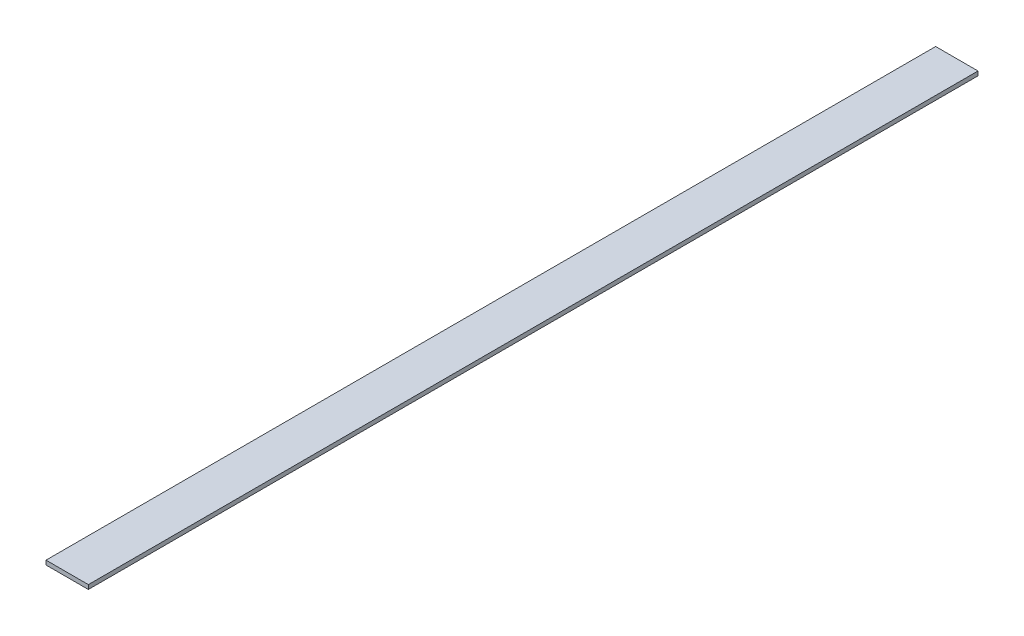
ISO-10303-21;
HEADER;
FILE_DESCRIPTION(('STEP AP214'),'2;1');
FILE_NAME('part.step','',(''),(''),'','','');
FILE_SCHEMA(('AUTOMOTIVE_DESIGN { 1 0 10303 214 1 1 1 1 }'));
ENDSEC;
DATA;
#1=APPLICATION_CONTEXT('core data for automotive mechanical design processes');
#2=APPLICATION_PROTOCOL_DEFINITION('international standard','automotive_design',2000,#1);
#3=PRODUCT_CONTEXT('',#1,'mechanical');
#4=PRODUCT('Part','Part','',(#3));
#5=PRODUCT_RELATED_PRODUCT_CATEGORY('part','',(#4));
#6=PRODUCT_DEFINITION_FORMATION('','',#4);
#7=PRODUCT_DEFINITION_CONTEXT('part definition',#1,'design');
#8=PRODUCT_DEFINITION('design','',#6,#7);
#9=PRODUCT_DEFINITION_SHAPE('','',#8);
#10=(LENGTH_UNIT() NAMED_UNIT(*) SI_UNIT(.MILLI.,.METRE.));
#11=(NAMED_UNIT(*) PLANE_ANGLE_UNIT() SI_UNIT($,.RADIAN.));
#12=(NAMED_UNIT(*) SI_UNIT($,.STERADIAN.) SOLID_ANGLE_UNIT());
#13=UNCERTAINTY_MEASURE_WITH_UNIT(LENGTH_MEASURE(1.E-05),#10,'distance_accuracy_value','');
#14=(GEOMETRIC_REPRESENTATION_CONTEXT(3) GLOBAL_UNCERTAINTY_ASSIGNED_CONTEXT((#13)) GLOBAL_UNIT_ASSIGNED_CONTEXT((#10,
#11,#12)) REPRESENTATION_CONTEXT('',''));
#15=CARTESIAN_POINT('',(0.,0.,0.));
#16=DIRECTION('',(0.,0.,1.));
#17=DIRECTION('',(1.,0.,0.));
#18=AXIS2_PLACEMENT_3D('',#15,#16,#17);
#19=CARTESIAN_POINT('',(-50.7999999999998,5.08,0.));
#20=DIRECTION('',(0.,0.,-1.));
#21=DIRECTION('',(-1.,0.,0.));
#22=AXIS2_PLACEMENT_3D('',#19,#20,#21);
#23=PLANE('',#22);
#24=DIRECTION('',(1.,0.,0.));
#25=VECTOR('',#24,1.);
#26=CARTESIAN_POINT('',(-50.7999999999998,0.,0.));
#27=LINE('',#26,#25);
#28=CARTESIAN_POINT('',(-50.7999999999998,0.,0.));
#29=VERTEX_POINT('',#28);
#30=CARTESIAN_POINT('',(0.,0.,0.));
#31=VERTEX_POINT('',#30);
#32=EDGE_CURVE('E108',#29,#31,#27,.T.);
#33=ORIENTED_EDGE('',*,*,#32,.T.);
#34=DIRECTION('',(0.,-1.,0.));
#35=VECTOR('',#34,1.);
#36=CARTESIAN_POINT('',(0.,5.08,0.));
#37=LINE('',#36,#35);
#38=CARTESIAN_POINT('',(0.,5.08,0.));
#39=VERTEX_POINT('',#38);
#40=EDGE_CURVE('E11',#39,#31,#37,.T.);
#41=ORIENTED_EDGE('',*,*,#40,.F.);
#42=DIRECTION('',(1.,0.,0.));
#43=VECTOR('',#42,1.);
#44=CARTESIAN_POINT('',(-50.7999999999998,5.08,0.));
#45=LINE('',#44,#43);
#46=CARTESIAN_POINT('',(-50.7999999999998,5.08,0.));
#47=VERTEX_POINT('',#46);
#48=EDGE_CURVE('E90',#47,#39,#45,.T.);
#49=ORIENTED_EDGE('',*,*,#48,.F.);
#50=DIRECTION('',(0.,-1.,0.));
#51=VECTOR('',#50,1.);
#52=CARTESIAN_POINT('',(-50.7999999999998,5.08,0.));
#53=LINE('',#52,#51);
#54=EDGE_CURVE('E104',#47,#29,#53,.T.);
#55=ORIENTED_EDGE('',*,*,#54,.T.);
#56=EDGE_LOOP('',(#33,#41,#49,#55));
#57=FACE_BOUND('',#56,.T.);
#58=ADVANCED_FACE('F38',(#57),#23,.F.);
#59=CARTESIAN_POINT('',(0.,5.08,0.));
#60=DIRECTION('',(-1.,0.,0.));
#61=DIRECTION('',(0.,0.,1.));
#62=AXIS2_PLACEMENT_3D('',#59,#60,#61);
#63=PLANE('',#62);
#64=DIRECTION('',(0.,0.,-1.));
#65=VECTOR('',#64,1.);
#66=CARTESIAN_POINT('',(0.,0.,0.));
#67=LINE('',#66,#65);
#68=CARTESIAN_POINT('',(0.,0.,-1066.8));
#69=VERTEX_POINT('',#68);
#70=EDGE_CURVE('E95',#31,#69,#67,.T.);
#71=ORIENTED_EDGE('',*,*,#70,.T.);
#72=DIRECTION('',(0.,-1.,0.));
#73=VECTOR('',#72,1.);
#74=CARTESIAN_POINT('',(0.,5.08,-1066.8));
#75=LINE('',#74,#73);
#76=CARTESIAN_POINT('',(0.,5.08,-1066.8));
#77=VERTEX_POINT('',#76);
#78=EDGE_CURVE('E47',#77,#69,#75,.T.);
#79=ORIENTED_EDGE('',*,*,#78,.F.);
#80=DIRECTION('',(0.,0.,-1.));
#81=VECTOR('',#80,1.);
#82=CARTESIAN_POINT('',(0.,5.08,0.));
#83=LINE('',#82,#81);
#84=EDGE_CURVE('E85',#39,#77,#83,.T.);
#85=ORIENTED_EDGE('',*,*,#84,.F.);
#86=ORIENTED_EDGE('',*,*,#40,.T.);
#87=EDGE_LOOP('',(#71,#79,#85,#86));
#88=FACE_BOUND('',#87,.T.);
#89=ADVANCED_FACE('F94',(#88),#63,.F.);
#90=CARTESIAN_POINT('',(0.,5.08,-1066.8));
#91=DIRECTION('',(0.,0.,1.));
#92=DIRECTION('',(1.,0.,0.));
#93=AXIS2_PLACEMENT_3D('',#90,#91,#92);
#94=PLANE('',#93);
#95=DIRECTION('',(-1.,0.,0.));
#96=VECTOR('',#95,1.);
#97=CARTESIAN_POINT('',(0.,0.,-1066.8));
#98=LINE('',#97,#96);
#99=CARTESIAN_POINT('',(-50.7999999999999,0.,-1066.8));
#100=VERTEX_POINT('',#99);
#101=EDGE_CURVE('E72',#69,#100,#98,.T.);
#102=ORIENTED_EDGE('',*,*,#101,.T.);
#103=DIRECTION('',(0.,-1.,0.));
#104=VECTOR('',#103,1.);
#105=CARTESIAN_POINT('',(-50.7999999999999,5.08,-1066.8));
#106=LINE('',#105,#104);
#107=CARTESIAN_POINT('',(-50.7999999999999,5.08,-1066.8));
#108=VERTEX_POINT('',#107);
#109=EDGE_CURVE('E97',#108,#100,#106,.T.);
#110=ORIENTED_EDGE('',*,*,#109,.F.);
#111=DIRECTION('',(-1.,0.,0.));
#112=VECTOR('',#111,1.);
#113=CARTESIAN_POINT('',(0.,5.08,-1066.8));
#114=LINE('',#113,#112);
#115=EDGE_CURVE('E88',#77,#108,#114,.T.);
#116=ORIENTED_EDGE('',*,*,#115,.F.);
#117=ORIENTED_EDGE('',*,*,#78,.T.);
#118=EDGE_LOOP('',(#102,#110,#116,#117));
#119=FACE_BOUND('',#118,.T.);
#120=ADVANCED_FACE('F98',(#119),#94,.F.);
#121=CARTESIAN_POINT('',(-50.7999999999999,5.08,-1066.8));
#122=DIRECTION('',(1.,0.,0.));
#123=DIRECTION('',(0.,0.,-1.));
#124=AXIS2_PLACEMENT_3D('',#121,#122,#123);
#125=PLANE('',#124);
#126=DIRECTION('',(0.,0.,1.));
#127=VECTOR('',#126,1.);
#128=CARTESIAN_POINT('',(-50.7999999999999,0.,-1066.8));
#129=LINE('',#128,#127);
#130=EDGE_CURVE('E78',#100,#29,#129,.T.);
#131=ORIENTED_EDGE('',*,*,#130,.T.);
#132=ORIENTED_EDGE('',*,*,#54,.F.);
#133=DIRECTION('',(0.,0.,1.));
#134=VECTOR('',#133,1.);
#135=CARTESIAN_POINT('',(-50.7999999999999,5.08,-1066.8));
#136=LINE('',#135,#134);
#137=EDGE_CURVE('E55',#108,#47,#136,.T.);
#138=ORIENTED_EDGE('',*,*,#137,.F.);
#139=ORIENTED_EDGE('',*,*,#109,.T.);
#140=EDGE_LOOP('',(#131,#132,#138,#139));
#141=FACE_BOUND('',#140,.T.);
#142=ADVANCED_FACE('F120',(#141),#125,.F.);
#143=CARTESIAN_POINT('',(0.,5.08,0.));
#144=DIRECTION('',(0.,1.,0.));
#145=DIRECTION('',(0.,0.,1.));
#146=AXIS2_PLACEMENT_3D('',#143,#144,#145);
#147=PLANE('',#146);
#148=ORIENTED_EDGE('',*,*,#48,.T.);
#149=ORIENTED_EDGE('',*,*,#84,.T.);
#150=ORIENTED_EDGE('',*,*,#115,.T.);
#151=ORIENTED_EDGE('',*,*,#137,.T.);
#152=EDGE_LOOP('',(#148,#149,#150,#151));
#153=FACE_BOUND('',#152,.T.);
#154=ADVANCED_FACE('F86',(#153),#147,.T.);
#155=CARTESIAN_POINT('',(0.,0.,0.));
#156=DIRECTION('',(0.,1.,0.));
#157=DIRECTION('',(0.,0.,1.));
#158=AXIS2_PLACEMENT_3D('',#155,#156,#157);
#159=PLANE('',#158);
#160=ORIENTED_EDGE('',*,*,#32,.F.);
#161=ORIENTED_EDGE('',*,*,#130,.F.);
#162=ORIENTED_EDGE('',*,*,#101,.F.);
#163=ORIENTED_EDGE('',*,*,#70,.F.);
#164=EDGE_LOOP('',(#160,#161,#162,#163));
#165=FACE_BOUND('',#164,.T.);
#166=ADVANCED_FACE('F123',(#165),#159,.F.);
#167=CLOSED_SHELL('',(#58,#89,#120,#142,#154,#166));
#168=MANIFOLD_SOLID_BREP('B2',#167);
#169=ADVANCED_BREP_SHAPE_REPRESENTATION('',(#18,#168),#14);
#170=SHAPE_DEFINITION_REPRESENTATION(#9,#169);
ENDSEC;
END-ISO-10303-21;
